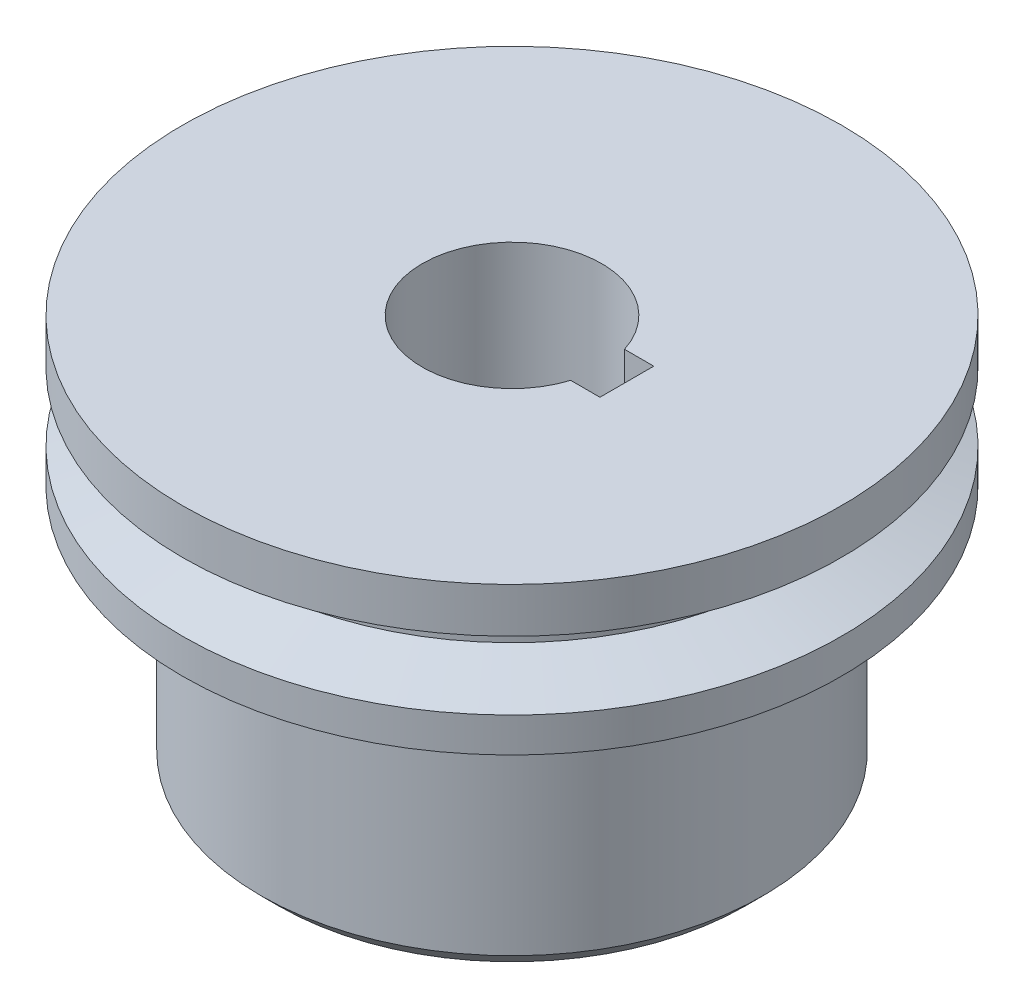
ISO-10303-21;
HEADER;
FILE_DESCRIPTION(('STEP AP214'),'2;1');
FILE_NAME('part.step','',(''),(''),'','','');
FILE_SCHEMA(('AUTOMOTIVE_DESIGN { 1 0 10303 214 1 1 1 1 }'));
ENDSEC;
DATA;
#1=APPLICATION_CONTEXT('core data for automotive mechanical design processes');
#2=APPLICATION_PROTOCOL_DEFINITION('international standard','automotive_design',2000,#1);
#3=PRODUCT_CONTEXT('',#1,'mechanical');
#4=PRODUCT('Part','Part','',(#3));
#5=PRODUCT_RELATED_PRODUCT_CATEGORY('part','',(#4));
#6=PRODUCT_DEFINITION_FORMATION('','',#4);
#7=PRODUCT_DEFINITION_CONTEXT('part definition',#1,'design');
#8=PRODUCT_DEFINITION('design','',#6,#7);
#9=PRODUCT_DEFINITION_SHAPE('','',#8);
#10=(LENGTH_UNIT() NAMED_UNIT(*) SI_UNIT(.MILLI.,.METRE.));
#11=(NAMED_UNIT(*) PLANE_ANGLE_UNIT() SI_UNIT($,.RADIAN.));
#12=(NAMED_UNIT(*) SI_UNIT($,.STERADIAN.) SOLID_ANGLE_UNIT());
#13=UNCERTAINTY_MEASURE_WITH_UNIT(LENGTH_MEASURE(1.E-05),#10,'distance_accuracy_value','');
#14=(GEOMETRIC_REPRESENTATION_CONTEXT(3) GLOBAL_UNCERTAINTY_ASSIGNED_CONTEXT((#13)) GLOBAL_UNIT_ASSIGNED_CONTEXT((#10,
#11,#12)) REPRESENTATION_CONTEXT('',''));
#15=CARTESIAN_POINT('',(0.,0.,0.));
#16=DIRECTION('',(0.,0.,1.));
#17=DIRECTION('',(1.,0.,0.));
#18=AXIS2_PLACEMENT_3D('',#15,#16,#17);
#19=CARTESIAN_POINT('',(0.,22.,0.));
#20=DIRECTION('',(0.,-1.,0.));
#21=DIRECTION('',(0.,0.,-1.));
#22=AXIS2_PLACEMENT_3D('',#19,#20,#21);
#23=CYLINDRICAL_SURFACE('',#22,14.);
#24=CARTESIAN_POINT('',(0.,1.,0.));
#25=DIRECTION('',(0.,1.,0.));
#26=DIRECTION('',(0.,0.,1.));
#27=AXIS2_PLACEMENT_3D('',#24,#25,#26);
#28=CIRCLE('',#27,14.);
#29=CARTESIAN_POINT('',(0.,1.,14.));
#30=VERTEX_POINT('',#29);
#31=EDGE_CURVE('E119',#30,#30,#28,.T.);
#32=ORIENTED_EDGE('',*,*,#31,.T.);
#33=EDGE_LOOP('',(#32));
#34=FACE_BOUND('',#33,.T.);
#35=CARTESIAN_POINT('',(0.,13.7697589024309,0.));
#36=DIRECTION('',(0.,1.,0.));
#37=DIRECTION('',(0.,0.,1.));
#38=AXIS2_PLACEMENT_3D('',#35,#36,#37);
#39=CIRCLE('',#38,14.);
#40=CARTESIAN_POINT('',(0.,13.7697589024309,14.));
#41=VERTEX_POINT('',#40);
#42=EDGE_CURVE('E12',#41,#41,#39,.T.);
#43=ORIENTED_EDGE('',*,*,#42,.F.);
#44=EDGE_LOOP('',(#43));
#45=FACE_BOUND('',#44,.T.);
#46=ADVANCED_FACE('F58',(#34,#45),#23,.T.);
#47=CARTESIAN_POINT('',(0.,22.,0.));
#48=DIRECTION('',(0.,1.,0.));
#49=DIRECTION('',(0.,0.,1.));
#50=AXIS2_PLACEMENT_3D('',#47,#48,#49);
#51=PLANE('',#50);
#52=DIRECTION('',(1.,0.,0.));
#53=VECTOR('',#52,1.);
#54=CARTESIAN_POINT('',(4.76969600708473,22.,1.5));
#55=LINE('',#54,#53);
#56=CARTESIAN_POINT('',(4.76969600708473,22.,1.5));
#57=VERTEX_POINT('',#56);
#58=CARTESIAN_POINT('',(6.4,22.,1.5));
#59=VERTEX_POINT('',#58);
#60=EDGE_CURVE('E111',#57,#59,#55,.T.);
#61=ORIENTED_EDGE('',*,*,#60,.F.);
#62=CARTESIAN_POINT('',(0.,22.,0.));
#63=DIRECTION('',(0.,1.,0.));
#64=DIRECTION('',(0.,0.,1.));
#65=AXIS2_PLACEMENT_3D('',#62,#63,#64);
#66=CIRCLE('',#65,5.);
#67=CARTESIAN_POINT('',(4.76969600708473,22.,-1.5));
#68=VERTEX_POINT('',#67);
#69=EDGE_CURVE('E101',#68,#57,#66,.T.);
#70=ORIENTED_EDGE('',*,*,#69,.F.);
#71=DIRECTION('',(1.,0.,0.));
#72=VECTOR('',#71,1.);
#73=CARTESIAN_POINT('',(4.76969600708473,22.,-1.5));
#74=LINE('',#73,#72);
#75=CARTESIAN_POINT('',(6.4,22.,-1.5));
#76=VERTEX_POINT('',#75);
#77=EDGE_CURVE('E127',#68,#76,#74,.T.);
#78=ORIENTED_EDGE('',*,*,#77,.T.);
#79=DIRECTION('',(0.,0.,1.));
#80=VECTOR('',#79,1.);
#81=CARTESIAN_POINT('',(6.4,22.,-1.5));
#82=LINE('',#81,#80);
#83=EDGE_CURVE('E75',#76,#59,#82,.T.);
#84=ORIENTED_EDGE('',*,*,#83,.T.);
#85=EDGE_LOOP('',(#61,#70,#78,#84));
#86=FACE_BOUND('',#85,.T.);
#87=CARTESIAN_POINT('',(0.,22.,0.));
#88=DIRECTION('',(0.,1.,0.));
#89=DIRECTION('',(0.,0.,1.));
#90=AXIS2_PLACEMENT_3D('',#87,#88,#89);
#91=CIRCLE('',#90,18.362757192998);
#92=CARTESIAN_POINT('',(0.,22.,18.362757192998));
#93=VERTEX_POINT('',#92);
#94=EDGE_CURVE('E301',#93,#93,#91,.T.);
#95=ORIENTED_EDGE('',*,*,#94,.T.);
#96=EDGE_LOOP('',(#95));
#97=FACE_BOUND('',#96,.T.);
#98=ADVANCED_FACE('F122',(#86,#97),#51,.T.);
#99=CARTESIAN_POINT('',(0.,0.,0.));
#100=DIRECTION('',(0.,1.,0.));
#101=DIRECTION('',(0.,0.,1.));
#102=AXIS2_PLACEMENT_3D('',#99,#100,#101);
#103=PLANE('',#102);
#104=CARTESIAN_POINT('',(0.,0.,0.));
#105=DIRECTION('',(0.,1.,0.));
#106=DIRECTION('',(0.,0.,1.));
#107=AXIS2_PLACEMENT_3D('',#104,#105,#106);
#108=CIRCLE('',#107,13.);
#109=CARTESIAN_POINT('',(0.,0.,13.));
#110=VERTEX_POINT('',#109);
#111=EDGE_CURVE('E68',#110,#110,#108,.F.);
#112=ORIENTED_EDGE('',*,*,#111,.T.);
#113=EDGE_LOOP('',(#112));
#114=FACE_BOUND('',#113,.T.);
#115=CARTESIAN_POINT('',(0.,0.,0.));
#116=DIRECTION('',(0.,1.,0.));
#117=DIRECTION('',(0.,0.,1.));
#118=AXIS2_PLACEMENT_3D('',#115,#116,#117);
#119=CIRCLE('',#118,5.);
#120=CARTESIAN_POINT('',(4.76969600708473,0.,-1.5));
#121=VERTEX_POINT('',#120);
#122=CARTESIAN_POINT('',(4.76969600708473,0.,1.5));
#123=VERTEX_POINT('',#122);
#124=EDGE_CURVE('E83',#121,#123,#119,.T.);
#125=ORIENTED_EDGE('',*,*,#124,.T.);
#126=DIRECTION('',(1.,0.,0.));
#127=VECTOR('',#126,1.);
#128=CARTESIAN_POINT('',(4.76969600708473,0.,1.5));
#129=LINE('',#128,#127);
#130=CARTESIAN_POINT('',(6.4,0.,1.5));
#131=VERTEX_POINT('',#130);
#132=EDGE_CURVE('E117',#123,#131,#129,.T.);
#133=ORIENTED_EDGE('',*,*,#132,.T.);
#134=DIRECTION('',(0.,0.,1.));
#135=VECTOR('',#134,1.);
#136=CARTESIAN_POINT('',(6.4,0.,-1.5));
#137=LINE('',#136,#135);
#138=CARTESIAN_POINT('',(6.4,0.,-1.5));
#139=VERTEX_POINT('',#138);
#140=EDGE_CURVE('E138',#139,#131,#137,.T.);
#141=ORIENTED_EDGE('',*,*,#140,.F.);
#142=DIRECTION('',(1.,0.,0.));
#143=VECTOR('',#142,1.);
#144=CARTESIAN_POINT('',(4.76969600708473,0.,-1.5));
#145=LINE('',#144,#143);
#146=EDGE_CURVE('E112',#121,#139,#145,.T.);
#147=ORIENTED_EDGE('',*,*,#146,.F.);
#148=EDGE_LOOP('',(#125,#133,#141,#147));
#149=FACE_BOUND('',#148,.T.);
#150=ADVANCED_FACE('F158',(#114,#149),#103,.F.);
#151=CARTESIAN_POINT('',(0.,22.,0.));
#152=DIRECTION('',(0.,-1.,0.));
#153=DIRECTION('',(0.,0.,-1.));
#154=AXIS2_PLACEMENT_3D('',#151,#152,#153);
#155=CYLINDRICAL_SURFACE('',#154,5.);
#156=ORIENTED_EDGE('',*,*,#124,.F.);
#157=DIRECTION('',(0.,-1.,0.));
#158=VECTOR('',#157,1.);
#159=CARTESIAN_POINT('',(4.76969600708473,22.,-1.5));
#160=LINE('',#159,#158);
#161=EDGE_CURVE('E105',#68,#121,#160,.T.);
#162=ORIENTED_EDGE('',*,*,#161,.F.);
#163=ORIENTED_EDGE('',*,*,#69,.T.);
#164=DIRECTION('',(0.,-1.,0.));
#165=VECTOR('',#164,1.);
#166=CARTESIAN_POINT('',(4.76969600708473,22.,1.5));
#167=LINE('',#166,#165);
#168=EDGE_CURVE('E104',#57,#123,#167,.T.);
#169=ORIENTED_EDGE('',*,*,#168,.T.);
#170=EDGE_LOOP('',(#156,#162,#163,#169));
#171=FACE_BOUND('',#170,.T.);
#172=ADVANCED_FACE('F103',(#171),#155,.F.);
#173=CARTESIAN_POINT('',(4.76969600708473,22.,1.5));
#174=DIRECTION('',(0.,0.,-1.));
#175=DIRECTION('',(-1.,0.,0.));
#176=AXIS2_PLACEMENT_3D('',#173,#174,#175);
#177=PLANE('',#176);
#178=ORIENTED_EDGE('',*,*,#132,.F.);
#179=ORIENTED_EDGE('',*,*,#168,.F.);
#180=ORIENTED_EDGE('',*,*,#60,.T.);
#181=DIRECTION('',(0.,-1.,0.));
#182=VECTOR('',#181,1.);
#183=CARTESIAN_POINT('',(6.4,22.,1.5));
#184=LINE('',#183,#182);
#185=EDGE_CURVE('E120',#59,#131,#184,.T.);
#186=ORIENTED_EDGE('',*,*,#185,.T.);
#187=EDGE_LOOP('',(#178,#179,#180,#186));
#188=FACE_BOUND('',#187,.T.);
#189=ADVANCED_FACE('F115',(#188),#177,.T.);
#190=CARTESIAN_POINT('',(6.4,22.,-1.5));
#191=DIRECTION('',(1.,0.,0.));
#192=DIRECTION('',(0.,0.,-1.));
#193=AXIS2_PLACEMENT_3D('',#190,#191,#192);
#194=PLANE('',#193);
#195=ORIENTED_EDGE('',*,*,#140,.T.);
#196=ORIENTED_EDGE('',*,*,#185,.F.);
#197=ORIENTED_EDGE('',*,*,#83,.F.);
#198=DIRECTION('',(0.,-1.,0.));
#199=VECTOR('',#198,1.);
#200=CARTESIAN_POINT('',(6.4,22.,-1.5));
#201=LINE('',#200,#199);
#202=EDGE_CURVE('E147',#76,#139,#201,.T.);
#203=ORIENTED_EDGE('',*,*,#202,.T.);
#204=EDGE_LOOP('',(#195,#196,#197,#203));
#205=FACE_BOUND('',#204,.T.);
#206=ADVANCED_FACE('F200',(#205),#194,.F.);
#207=CARTESIAN_POINT('',(4.76969600708473,22.,-1.5));
#208=DIRECTION('',(0.,0.,-1.));
#209=DIRECTION('',(-1.,0.,0.));
#210=AXIS2_PLACEMENT_3D('',#207,#208,#209);
#211=PLANE('',#210);
#212=ORIENTED_EDGE('',*,*,#146,.T.);
#213=ORIENTED_EDGE('',*,*,#202,.F.);
#214=ORIENTED_EDGE('',*,*,#77,.F.);
#215=ORIENTED_EDGE('',*,*,#161,.T.);
#216=EDGE_LOOP('',(#212,#213,#214,#215));
#217=FACE_BOUND('',#216,.T.);
#218=ADVANCED_FACE('F164',(#217),#211,.F.);
#219=CARTESIAN_POINT('',(0.,1.,0.));
#220=DIRECTION('',(0.,1.,0.));
#221=DIRECTION('',(0.,0.,1.));
#222=AXIS2_PLACEMENT_3D('',#219,#220,#221);
#223=CONICAL_SURFACE('',#222,14.,0.785398163397449);
#224=ORIENTED_EDGE('',*,*,#111,.F.);
#225=EDGE_LOOP('',(#224));
#226=FACE_BOUND('',#225,.T.);
#227=ORIENTED_EDGE('',*,*,#31,.F.);
#228=EDGE_LOOP('',(#227));
#229=FACE_BOUND('',#228,.T.);
#230=ADVANCED_FACE('F61',(#226,#229),#223,.T.);
#231=CARTESIAN_POINT('',(0.,22.,0.));
#232=DIRECTION('',(0.,1.,0.));
#233=DIRECTION('',(0.,0.,1.));
#234=AXIS2_PLACEMENT_3D('',#231,#232,#233);
#235=CYLINDRICAL_SURFACE('',#234,18.362757192998);
#236=ORIENTED_EDGE('',*,*,#94,.F.);
#237=EDGE_LOOP('',(#236));
#238=FACE_BOUND('',#237,.T.);
#239=CARTESIAN_POINT('',(0.,19.5,0.));
#240=DIRECTION('',(0.,1.,0.));
#241=DIRECTION('',(0.,0.,1.));
#242=AXIS2_PLACEMENT_3D('',#239,#240,#241);
#243=CIRCLE('',#242,18.362757192998);
#244=CARTESIAN_POINT('',(0.,19.5,18.362757192998));
#245=VERTEX_POINT('',#244);
#246=EDGE_CURVE('E135',#245,#245,#243,.T.);
#247=ORIENTED_EDGE('',*,*,#246,.T.);
#248=EDGE_LOOP('',(#247));
#249=FACE_BOUND('',#248,.T.);
#250=ADVANCED_FACE('F163',(#238,#249),#235,.T.);
#251=CARTESIAN_POINT('',(0.,18.6544205025849,0.));
#252=DIRECTION('',(0.,1.,0.));
#253=DIRECTION('',(0.,0.,1.));
#254=AXIS2_PLACEMENT_3D('',#251,#252,#253);
#255=CONICAL_SURFACE('',#254,15.,1.32444945212529);
#256=ORIENTED_EDGE('',*,*,#246,.F.);
#257=EDGE_LOOP('',(#256));
#258=FACE_BOUND('',#257,.T.);
#259=CARTESIAN_POINT('',(0.,18.6544205025849,0.));
#260=DIRECTION('',(0.,1.,0.));
#261=DIRECTION('',(0.,0.,1.));
#262=AXIS2_PLACEMENT_3D('',#259,#260,#261);
#263=CIRCLE('',#262,15.);
#264=CARTESIAN_POINT('',(0.,18.6544205025849,15.));
#265=VERTEX_POINT('',#264);
#266=EDGE_CURVE('E305',#265,#265,#263,.T.);
#267=ORIENTED_EDGE('',*,*,#266,.T.);
#268=EDGE_LOOP('',(#267));
#269=FACE_BOUND('',#268,.T.);
#270=ADVANCED_FACE('F190',(#258,#269),#255,.T.);
#271=CARTESIAN_POINT('',(0.,22.,0.));
#272=DIRECTION('',(0.,1.,0.));
#273=DIRECTION('',(0.,0.,1.));
#274=AXIS2_PLACEMENT_3D('',#271,#272,#273);
#275=CYLINDRICAL_SURFACE('',#274,15.);
#276=ORIENTED_EDGE('',*,*,#266,.F.);
#277=EDGE_LOOP('',(#276));
#278=FACE_BOUND('',#277,.T.);
#279=CARTESIAN_POINT('',(0.,16.8119604253339,0.));
#280=DIRECTION('',(0.,1.,0.));
#281=DIRECTION('',(0.,0.,1.));
#282=AXIS2_PLACEMENT_3D('',#279,#280,#281);
#283=CIRCLE('',#282,15.);
#284=CARTESIAN_POINT('',(0.,16.8119604253339,15.));
#285=VERTEX_POINT('',#284);
#286=EDGE_CURVE('E308',#285,#285,#283,.T.);
#287=ORIENTED_EDGE('',*,*,#286,.T.);
#288=EDGE_LOOP('',(#287));
#289=FACE_BOUND('',#288,.T.);
#290=ADVANCED_FACE('F186',(#278,#289),#275,.T.);
#291=CARTESIAN_POINT('',(0.,15.6979147972286,0.));
#292=DIRECTION('',(0.,-1.,0.));
#293=DIRECTION('',(0.,0.,-1.));
#294=AXIS2_PLACEMENT_3D('',#291,#292,#293);
#295=CONICAL_SURFACE('',#294,18.362757192998,1.25088648847619);
#296=ORIENTED_EDGE('',*,*,#286,.F.);
#297=EDGE_LOOP('',(#296));
#298=FACE_BOUND('',#297,.T.);
#299=CARTESIAN_POINT('',(0.,15.6979147972286,0.));
#300=DIRECTION('',(0.,1.,0.));
#301=DIRECTION('',(0.,0.,1.));
#302=AXIS2_PLACEMENT_3D('',#299,#300,#301);
#303=CIRCLE('',#302,18.362757192998);
#304=CARTESIAN_POINT('',(0.,15.6979147972286,18.362757192998));
#305=VERTEX_POINT('',#304);
#306=EDGE_CURVE('E314',#305,#305,#303,.T.);
#307=ORIENTED_EDGE('',*,*,#306,.T.);
#308=EDGE_LOOP('',(#307));
#309=FACE_BOUND('',#308,.T.);
#310=ADVANCED_FACE('F179',(#298,#309),#295,.T.);
#311=CARTESIAN_POINT('',(0.,22.,0.));
#312=DIRECTION('',(0.,1.,0.));
#313=DIRECTION('',(0.,0.,1.));
#314=AXIS2_PLACEMENT_3D('',#311,#312,#313);
#315=CYLINDRICAL_SURFACE('',#314,18.362757192998);
#316=ORIENTED_EDGE('',*,*,#306,.F.);
#317=EDGE_LOOP('',(#316));
#318=FACE_BOUND('',#317,.T.);
#319=CARTESIAN_POINT('',(0.,13.7697589024309,0.));
#320=DIRECTION('',(0.,1.,0.));
#321=DIRECTION('',(0.,0.,1.));
#322=AXIS2_PLACEMENT_3D('',#319,#320,#321);
#323=CIRCLE('',#322,18.362757192998);
#324=CARTESIAN_POINT('',(0.,13.7697589024309,18.362757192998));
#325=VERTEX_POINT('',#324);
#326=EDGE_CURVE('E318',#325,#325,#323,.T.);
#327=ORIENTED_EDGE('',*,*,#326,.T.);
#328=EDGE_LOOP('',(#327));
#329=FACE_BOUND('',#328,.T.);
#330=ADVANCED_FACE('F173',(#318,#329),#315,.T.);
#331=CARTESIAN_POINT('',(0.,13.7697589024309,-18.362757192998));
#332=DIRECTION('',(0.,1.,0.));
#333=DIRECTION('',(0.,0.,1.));
#334=AXIS2_PLACEMENT_3D('',#331,#332,#333);
#335=PLANE('',#334);
#336=ORIENTED_EDGE('',*,*,#326,.F.);
#337=EDGE_LOOP('',(#336));
#338=FACE_BOUND('',#337,.T.);
#339=ORIENTED_EDGE('',*,*,#42,.T.);
#340=EDGE_LOOP('',(#339));
#341=FACE_BOUND('',#340,.T.);
#342=ADVANCED_FACE('F171',(#338,#341),#335,.F.);
#343=CLOSED_SHELL('',(#46,#98,#150,#172,#189,#206,#218,#230,#250,#270,#290,#310,#330,#342));
#344=MANIFOLD_SOLID_BREP('B2',#343);
#345=ADVANCED_BREP_SHAPE_REPRESENTATION('',(#18,#344),#14);
#346=SHAPE_DEFINITION_REPRESENTATION(#9,#345);
ENDSEC;
END-ISO-10303-21;
